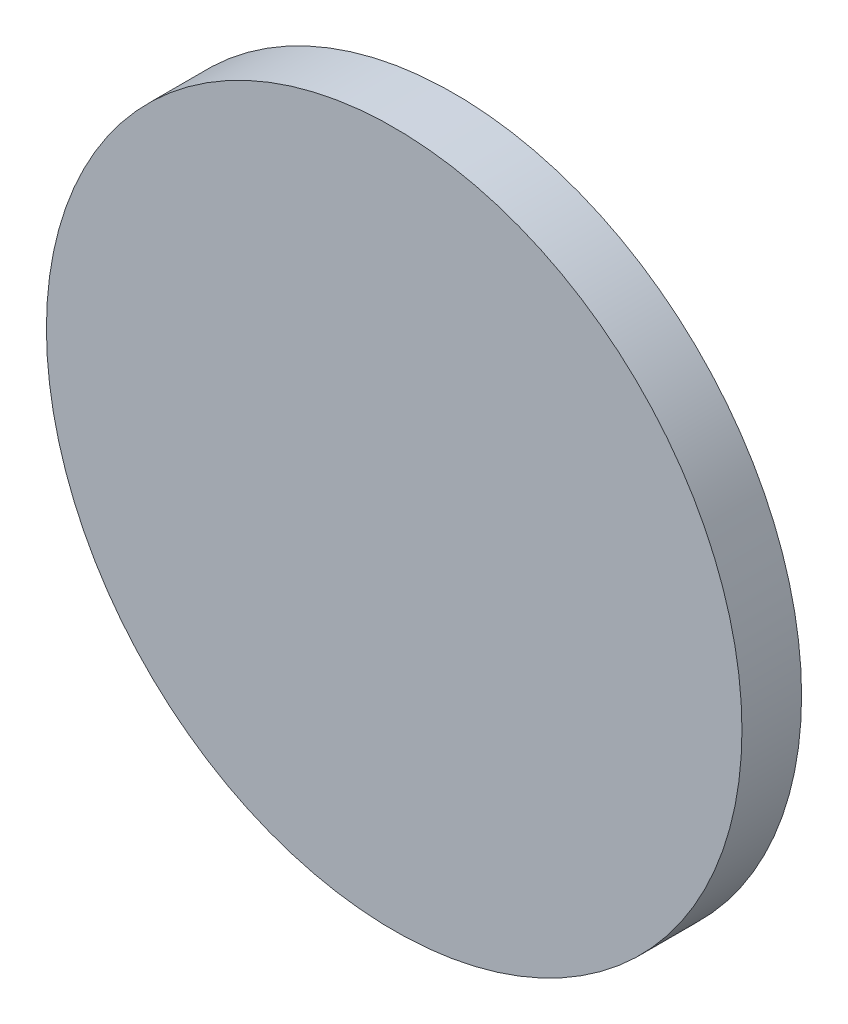
ISO-10303-21;
HEADER;
FILE_DESCRIPTION(('STEP AP214'),'2;1');
FILE_NAME('part.step','',(''),(''),'','','');
FILE_SCHEMA(('AUTOMOTIVE_DESIGN { 1 0 10303 214 1 1 1 1 }'));
ENDSEC;
DATA;
#1=APPLICATION_CONTEXT('core data for automotive mechanical design processes');
#2=APPLICATION_PROTOCOL_DEFINITION('international standard','automotive_design',2000,#1);
#3=PRODUCT_CONTEXT('',#1,'mechanical');
#4=PRODUCT('Part','Part','',(#3));
#5=PRODUCT_RELATED_PRODUCT_CATEGORY('part','',(#4));
#6=PRODUCT_DEFINITION_FORMATION('','',#4);
#7=PRODUCT_DEFINITION_CONTEXT('part definition',#1,'design');
#8=PRODUCT_DEFINITION('design','',#6,#7);
#9=PRODUCT_DEFINITION_SHAPE('','',#8);
#10=(LENGTH_UNIT() NAMED_UNIT(*) SI_UNIT(.MILLI.,.METRE.));
#11=(NAMED_UNIT(*) PLANE_ANGLE_UNIT() SI_UNIT($,.RADIAN.));
#12=(NAMED_UNIT(*) SI_UNIT($,.STERADIAN.) SOLID_ANGLE_UNIT());
#13=UNCERTAINTY_MEASURE_WITH_UNIT(LENGTH_MEASURE(1.E-05),#10,'distance_accuracy_value','');
#14=(GEOMETRIC_REPRESENTATION_CONTEXT(3) GLOBAL_UNCERTAINTY_ASSIGNED_CONTEXT((#13)) GLOBAL_UNIT_ASSIGNED_CONTEXT((#10,
#11,#12)) REPRESENTATION_CONTEXT('',''));
#15=CARTESIAN_POINT('',(0.,0.,0.));
#16=DIRECTION('',(0.,0.,1.));
#17=DIRECTION('',(1.,0.,0.));
#18=AXIS2_PLACEMENT_3D('',#15,#16,#17);
#19=CARTESIAN_POINT('',(9.01,9.806000014875,0.03429));
#20=DIRECTION('',(0.,0.,1.));
#21=DIRECTION('',(1.,0.,0.));
#22=AXIS2_PLACEMENT_3D('',#19,#20,#21);
#23=PLANE('',#22);
#24=CARTESIAN_POINT('',(9.01,9.806000014875,0.03429));
#25=DIRECTION('',(0.,0.,1.));
#26=DIRECTION('',(1.,0.,0.));
#27=AXIS2_PLACEMENT_3D('',#24,#25,#26);
#28=CIRCLE('',#27,0.200024667);
#29=CARTESIAN_POINT('',(9.210024667,9.806000014875,0.03429));
#30=VERTEX_POINT('',#29);
#31=EDGE_CURVE('E18',#30,#30,#28,.F.);
#32=ORIENTED_EDGE('',*,*,#31,.F.);
#33=EDGE_LOOP('',(#32));
#34=FACE_BOUND('',#33,.T.);
#35=ADVANCED_FACE('F15',(#34),#23,.T.);
#36=CARTESIAN_POINT('',(9.01,9.806000014875,0.));
#37=DIRECTION('',(0.,0.,1.));
#38=DIRECTION('',(1.,0.,0.));
#39=AXIS2_PLACEMENT_3D('',#36,#37,#38);
#40=CYLINDRICAL_SURFACE('',#39,0.200024667);
#41=ORIENTED_EDGE('',*,*,#31,.T.);
#42=EDGE_LOOP('',(#41));
#43=FACE_BOUND('',#42,.T.);
#44=CARTESIAN_POINT('',(9.01,9.806000014875,0.));
#45=DIRECTION('',(0.,0.,1.));
#46=DIRECTION('',(1.,0.,0.));
#47=AXIS2_PLACEMENT_3D('',#44,#45,#46);
#48=CIRCLE('',#47,0.200024667);
#49=CARTESIAN_POINT('',(9.210024667,9.806000014875,0.));
#50=VERTEX_POINT('',#49);
#51=EDGE_CURVE('E10',#50,#50,#48,.F.);
#52=ORIENTED_EDGE('',*,*,#51,.F.);
#53=EDGE_LOOP('',(#52));
#54=FACE_BOUND('',#53,.T.);
#55=ADVANCED_FACE('F27',(#43,#54),#40,.T.);
#56=CARTESIAN_POINT('',(9.01,9.806000014875,0.));
#57=DIRECTION('',(0.,0.,-1.));
#58=DIRECTION('',(-1.,0.,0.));
#59=AXIS2_PLACEMENT_3D('',#56,#57,#58);
#60=PLANE('',#59);
#61=ORIENTED_EDGE('',*,*,#51,.T.);
#62=EDGE_LOOP('',(#61));
#63=FACE_BOUND('',#62,.T.);
#64=ADVANCED_FACE('F35',(#63),#60,.T.);
#65=CLOSED_SHELL('',(#35,#55,#64));
#66=MANIFOLD_SOLID_BREP('B1',#65);
#67=ADVANCED_BREP_SHAPE_REPRESENTATION('',(#18,#66),#14);
#68=SHAPE_DEFINITION_REPRESENTATION(#9,#67);
ENDSEC;
END-ISO-10303-21;
